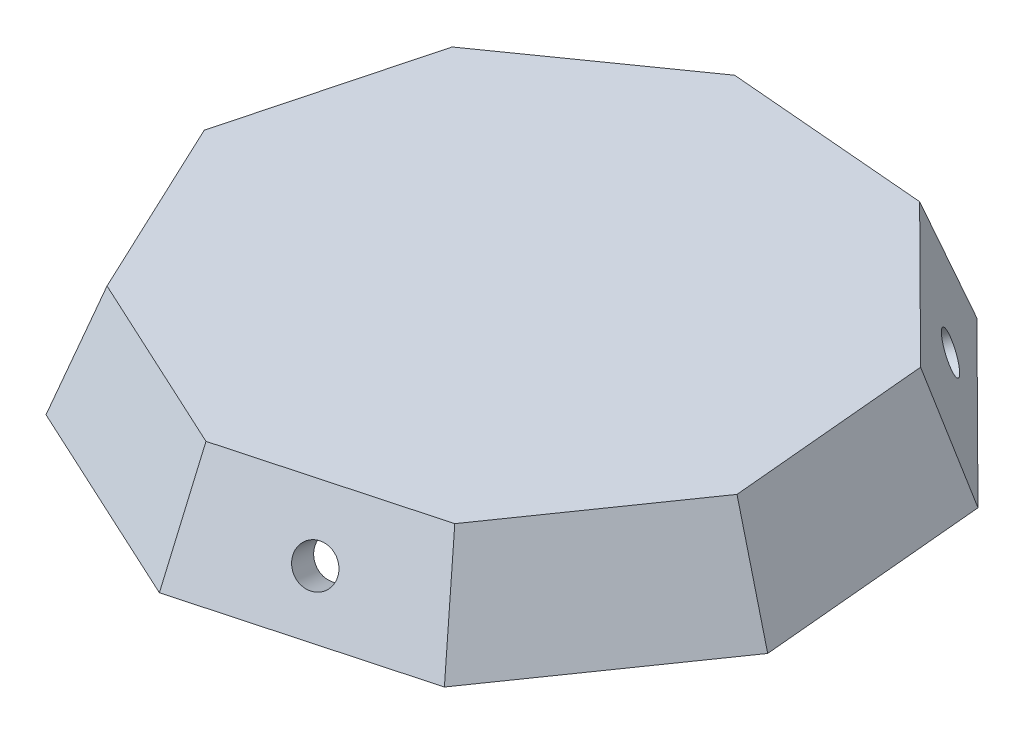
ISO-10303-21;
HEADER;
FILE_DESCRIPTION(('STEP AP214'),'2;1');
FILE_NAME('part.step','',(''),(''),'','','');
FILE_SCHEMA(('AUTOMOTIVE_DESIGN { 1 0 10303 214 1 1 1 1 }'));
ENDSEC;
DATA;
#1=APPLICATION_CONTEXT('core data for automotive mechanical design processes');
#2=APPLICATION_PROTOCOL_DEFINITION('international standard','automotive_design',2000,#1);
#3=PRODUCT_CONTEXT('',#1,'mechanical');
#4=PRODUCT('Part','Part','',(#3));
#5=PRODUCT_RELATED_PRODUCT_CATEGORY('part','',(#4));
#6=PRODUCT_DEFINITION_FORMATION('','',#4);
#7=PRODUCT_DEFINITION_CONTEXT('part definition',#1,'design');
#8=PRODUCT_DEFINITION('design','',#6,#7);
#9=PRODUCT_DEFINITION_SHAPE('','',#8);
#10=(LENGTH_UNIT() NAMED_UNIT(*) SI_UNIT(.MILLI.,.METRE.));
#11=(NAMED_UNIT(*) PLANE_ANGLE_UNIT() SI_UNIT($,.RADIAN.));
#12=(NAMED_UNIT(*) SI_UNIT($,.STERADIAN.) SOLID_ANGLE_UNIT());
#13=UNCERTAINTY_MEASURE_WITH_UNIT(LENGTH_MEASURE(1.E-05),#10,'distance_accuracy_value','');
#14=(GEOMETRIC_REPRESENTATION_CONTEXT(3) GLOBAL_UNCERTAINTY_ASSIGNED_CONTEXT((#13)) GLOBAL_UNIT_ASSIGNED_CONTEXT((#10,
#11,#12)) REPRESENTATION_CONTEXT('',''));
#15=CARTESIAN_POINT('',(0.,0.,0.));
#16=DIRECTION('',(0.,0.,1.));
#17=DIRECTION('',(1.,0.,0.));
#18=AXIS2_PLACEMENT_3D('',#15,#16,#17);
#19=CARTESIAN_POINT('',(15.3316909926271,10.,21.7424862527603));
#20=DIRECTION('',(0.771529898668877,0.342020143325669,0.536436237608423));
#21=DIRECTION('',(0.570863520413491,0.,-0.821044968964012));
#22=AXIS2_PLACEMENT_3D('',#19,#20,#21);
#23=PLANE('',#22);
#24=DIRECTION('',(-0.570863520413491,0.,0.821044968964012));
#25=VECTOR('',#24,1.);
#26=CARTESIAN_POINT('',(18.3200502895963,0.,23.8202595453495));
#27=LINE('',#26,#25);
#28=CARTESIAN_POINT('',(17.5638026575405,0.,24.907933378739));
#29=VERTEX_POINT('',#28);
#30=CARTESIAN_POINT('',(29.4651643845985,0.,7.79078922711416));
#31=VERTEX_POINT('',#30);
#32=EDGE_CURVE('E148',#29,#31,#27,.F.);
#33=ORIENTED_EDGE('',*,*,#32,.T.);
#34=DIRECTION('',(0.349182786412998,-0.932495167133387,0.0923262960685212));
#35=VECTOR('',#34,1.);
#36=CARTESIAN_POINT('',(25.7205574555735,10.,6.80068976791434));
#37=LINE('',#36,#35);
#38=CARTESIAN_POINT('',(25.7205574555735,10.,6.80068976791434));
#39=VERTEX_POINT('',#38);
#40=EDGE_CURVE('E11',#39,#31,#37,.T.);
#41=ORIENTED_EDGE('',*,*,#40,.F.);
#42=DIRECTION('',(0.570863520413491,0.,-0.821044968964012));
#43=VECTOR('',#42,1.);
#44=CARTESIAN_POINT('',(15.3316909926271,10.,21.7424862527603));
#45=LINE('',#44,#43);
#46=CARTESIAN_POINT('',(15.3316909926271,10.,21.7424862527603));
#47=VERTEX_POINT('',#46);
#48=EDGE_CURVE('E145',#47,#39,#45,.T.);
#49=ORIENTED_EDGE('',*,*,#48,.F.);
#50=DIRECTION('',(0.208143334003381,-0.932495167133387,0.295176414679144));
#51=VECTOR('',#50,1.);
#52=CARTESIAN_POINT('',(15.3316909926271,10.,21.7424862527603));
#53=LINE('',#52,#51);
#54=EDGE_CURVE('E169',#47,#29,#53,.T.);
#55=ORIENTED_EDGE('',*,*,#54,.T.);
#56=EDGE_LOOP('',(#33,#41,#49,#55));
#57=FACE_BOUND('',#56,.T.);
#58=ADVANCED_FACE('F45',(#57),#23,.T.);
#59=CARTESIAN_POINT('',(25.7205574555735,10.,6.80068976791434));
#60=DIRECTION('',(0.935840758497,0.342020143325669,-0.0849958604594809));
#61=DIRECTION('',(-0.343262305128028,0.939239580659904,0.));
#62=AXIS2_PLACEMENT_3D('',#59,#60,#61);
#63=PLANE('',#62);
#64=DIRECTION('',(0.0904507054534439,0.,0.995900933769506));
#65=VECTOR('',#64,1.);
#66=CARTESIAN_POINT('',(29.3453404172737,0.,6.47147612338001));
#67=LINE('',#66,#65);
#68=CARTESIAN_POINT('',(27.5794482272772,0.,-12.971751788855));
#69=VERTEX_POINT('',#68);
#70=EDGE_CURVE('E152',#31,#69,#67,.F.);
#71=ORIENTED_EDGE('',*,*,#70,.T.);
#72=DIRECTION('',(0.326835732325574,-0.932495167133387,-0.153724322565048));
#73=VECTOR('',#72,1.);
#74=CARTESIAN_POINT('',(24.0744892329018,10.,-11.3232250405865));
#75=LINE('',#74,#73);
#76=CARTESIAN_POINT('',(24.0744892329018,10.,-11.3232250405865));
#77=VERTEX_POINT('',#76);
#78=EDGE_CURVE('E55',#77,#69,#75,.T.);
#79=ORIENTED_EDGE('',*,*,#78,.F.);
#80=DIRECTION('',(-0.0904507054534439,0.,-0.995900933769506));
#81=VECTOR('',#80,1.);
#82=CARTESIAN_POINT('',(25.7205574555735,10.,6.80068976791434));
#83=LINE('',#82,#81);
#84=EDGE_CURVE('E209',#39,#77,#83,.T.);
#85=ORIENTED_EDGE('',*,*,#84,.F.);
#86=ORIENTED_EDGE('',*,*,#40,.T.);
#87=EDGE_LOOP('',(#71,#79,#85,#86));
#88=FACE_BOUND('',#87,.T.);
#89=ADVANCED_FACE('F349',(#88),#63,.T.);
#90=CARTESIAN_POINT('',(24.0744892329018,10.,-11.3232250405865));
#91=DIRECTION('',(0.662261326712877,0.342020143325669,-0.666657450794626));
#92=DIRECTION('',(-0.709442040991095,0.,-0.704763783458251));
#93=AXIS2_PLACEMENT_3D('',#90,#91,#92);
#94=PLANE('',#93);
#95=CARTESIAN_POINT('',(18.9790079289869,4.69846310392955,-19.1049915406506));
#96=DIRECTION('',(0.662261326712873,0.342020143325669,-0.666657450794629));
#97=DIRECTION('',(0.305605875423124,-0.935667354641855,-0.176441634441473));
#98=AXIS2_PLACEMENT_3D('',#95,#96,#97);
#99=CIRCLE('',#98,1.7);
#100=CARTESIAN_POINT('',(19.4985379172062,3.10782860103839,-19.4049423192011));
#101=VERTEX_POINT('',#100);
#102=EDGE_CURVE('E323',#101,#101,#99,.T.);
#103=ORIENTED_EDGE('',*,*,#102,.F.);
#104=EDGE_LOOP('',(#103));
#105=FACE_BOUND('',#104,.T.);
#106=DIRECTION('',(0.709442040991095,0.,0.704763783458251));
#107=VECTOR('',#106,1.);
#108=CARTESIAN_POINT('',(26.6396196265782,0.,-13.9053828991647));
#109=LINE('',#108,#107);
#110=CARTESIAN_POINT('',(12.789001732988,0.,-27.6646659778562));
#111=VERTEX_POINT('',#110);
#112=EDGE_CURVE('E156',#69,#111,#109,.F.);
#113=ORIENTED_EDGE('',*,*,#112,.T.);
#114=DIRECTION('',(0.151558606708458,-0.932495167133387,-0.32784562221489));
#115=VECTOR('',#114,1.);
#116=CARTESIAN_POINT('',(11.1636999400107,10.,-24.1488770089683));
#117=LINE('',#116,#115);
#118=CARTESIAN_POINT('',(11.1636999400107,10.,-24.1488770089683));
#119=VERTEX_POINT('',#118);
#120=EDGE_CURVE('E176',#119,#111,#117,.T.);
#121=ORIENTED_EDGE('',*,*,#120,.F.);
#122=DIRECTION('',(-0.709442040991095,0.,-0.704763783458252));
#123=VECTOR('',#122,1.);
#124=CARTESIAN_POINT('',(24.0744892329018,10.,-11.3232250405865));
#125=LINE('',#124,#123);
#126=EDGE_CURVE('E205',#77,#119,#125,.T.);
#127=ORIENTED_EDGE('',*,*,#126,.F.);
#128=ORIENTED_EDGE('',*,*,#78,.T.);
#129=EDGE_LOOP('',(#113,#121,#127,#128));
#130=FACE_BOUND('',#129,.T.);
#131=ADVANCED_FACE('F345',(#105,#130),#94,.T.);
#132=CARTESIAN_POINT('',(11.1636999400107,10.,-24.1488770089683));
#133=DIRECTION('',(0.0788024599450013,0.342020143325669,-0.936382610830693));
#134=DIRECTION('',(0.,0.939303609400127,0.343087058001163));
#135=AXIS2_PLACEMENT_3D('',#132,#133,#134);
#136=PLANE('',#135);
#137=DIRECTION('',(0.996477560978986,0.,0.0838598262898938));
#138=VECTOR('',#137,1.);
#139=CARTESIAN_POINT('',(11.4689247462133,0.,-27.7757587220736));
#140=LINE('',#139,#138);
#141=CARTESIAN_POINT('',(-7.98556080608825,0.,-29.4129754973038));
#142=VERTEX_POINT('',#141);
#143=EDGE_CURVE('E159',#111,#142,#140,.F.);
#144=ORIENTED_EDGE('',*,*,#143,.T.);
#145=DIRECTION('',(-0.0946344753738362,-0.932495167133387,-0.348564311632152));
#146=VECTOR('',#145,1.);
#147=CARTESIAN_POINT('',(-6.97070862551605,10.,-25.6750010399811));
#148=LINE('',#147,#146);
#149=CARTESIAN_POINT('',(-6.97070862551605,10.,-25.6750010399811));
#150=VERTEX_POINT('',#149);
#151=EDGE_CURVE('E180',#150,#142,#148,.T.);
#152=ORIENTED_EDGE('',*,*,#151,.F.);
#153=DIRECTION('',(-0.996477560978986,0.,-0.0838598262898938));
#154=VECTOR('',#153,1.);
#155=CARTESIAN_POINT('',(11.1636999400107,10.,-24.1488770089683));
#156=LINE('',#155,#154);
#157=EDGE_CURVE('E201',#119,#150,#156,.T.);
#158=ORIENTED_EDGE('',*,*,#157,.F.);
#159=ORIENTED_EDGE('',*,*,#120,.T.);
#160=EDGE_LOOP('',(#144,#152,#158,#159));
#161=FACE_BOUND('',#160,.T.);
#162=ADVANCED_FACE('F348',(#161),#136,.T.);
#163=CARTESIAN_POINT('',(-6.97070862551605,10.,-25.6750010399811));
#164=DIRECTION('',(-0.541528953622928,0.342020143325669,-0.76796394052556));
#165=DIRECTION('',(-0.817250155570314,0.,0.576283075597659));
#166=AXIS2_PLACEMENT_3D('',#163,#164,#165);
#167=PLANE('',#166);
#168=DIRECTION('',(0.817250155570314,0.,-0.576283075597659));
#169=VECTOR('',#168,1.);
#170=CARTESIAN_POINT('',(-9.06820748580533,0.,-28.6495483457512));
#171=LINE('',#170,#169);
#172=CARTESIAN_POINT('',(-25.0235906943733,0.,-17.3986268927523));
#173=VERTEX_POINT('',#172);
#174=EDGE_CURVE('E122',#142,#173,#171,.F.);
#175=ORIENTED_EDGE('',*,*,#174,.T.);
#176=DIRECTION('',(-0.296547034683672,-0.932495167133387,-0.206185885775914));
#177=VECTOR('',#176,1.);
#178=CARTESIAN_POINT('',(-21.8434451543669,10.,-15.1875067385347));
#179=LINE('',#178,#177);
#180=CARTESIAN_POINT('',(-21.8434451543669,10.,-15.1875067385347));
#181=VERTEX_POINT('',#180);
#182=EDGE_CURVE('E117',#181,#173,#179,.T.);
#183=ORIENTED_EDGE('',*,*,#182,.F.);
#184=DIRECTION('',(-0.817250155570314,0.,0.576283075597659));
#185=VECTOR('',#184,1.);
#186=CARTESIAN_POINT('',(-6.97070862551605,10.,-25.6750010399811));
#187=LINE('',#186,#185);
#188=EDGE_CURVE('E197',#150,#181,#187,.T.);
#189=ORIENTED_EDGE('',*,*,#188,.F.);
#190=ORIENTED_EDGE('',*,*,#151,.T.);
#191=EDGE_LOOP('',(#175,#183,#189,#190));
#192=FACE_BOUND('',#191,.T.);
#193=ADVANCED_FACE('F361',(#192),#167,.T.);
#194=CARTESIAN_POINT('',(-21.8434451543669,10.,-15.1875067385347));
#195=DIRECTION('',(-0.908472951366759,0.342020143325669,-0.240206407480024));
#196=DIRECTION('',(-0.352335891537493,-0.935873613013253,0.));
#197=AXIS2_PLACEMENT_3D('',#194,#195,#196);
#198=PLANE('',#197);
#199=CARTESIAN_POINT('',(-26.0349119777837,4.69846310392955,-6.88380723480354));
#200=DIRECTION('',(-0.908472951366761,0.342020143325669,-0.240206407480015));
#201=DIRECTION('',(-0.305605875423126,-0.935667354641855,-0.176441634441469));
#202=AXIS2_PLACEMENT_3D('',#199,#200,#201);
#203=CIRCLE('',#202,1.7);
#204=CARTESIAN_POINT('',(-26.554441966003,3.10782860103839,-7.18375801335404));
#205=VERTEX_POINT('',#204);
#206=EDGE_CURVE('E331',#205,#205,#203,.T.);
#207=ORIENTED_EDGE('',*,*,#206,.F.);
#208=EDGE_LOOP('',(#207));
#209=FACE_BOUND('',#208,.T.);
#210=DIRECTION('',(0.255622319646533,0.,-0.966776721740095));
#211=VECTOR('',#210,1.);
#212=CARTESIAN_POINT('',(-25.3622246533155,0.,-16.1178958941889));
#213=LINE('',#212,#211);
#214=CARTESIAN_POINT('',(-30.3528043905286,0.,2.75673259911723));
#215=VERTEX_POINT('',#214);
#216=EDGE_CURVE('E109',#173,#215,#213,.F.);
#217=ORIENTED_EDGE('',*,*,#216,.T.);
#218=DIRECTION('',(-0.35970194071184,-0.932495167133387,0.0326692075357454));
#219=VECTOR('',#218,1.);
#220=CARTESIAN_POINT('',(-26.4953909326379,10.,2.40639075620801));
#221=LINE('',#220,#219);
#222=CARTESIAN_POINT('',(-26.4953909326379,10.,2.40639075620801));
#223=VERTEX_POINT('',#222);
#224=EDGE_CURVE('E114',#223,#215,#221,.T.);
#225=ORIENTED_EDGE('',*,*,#224,.F.);
#226=DIRECTION('',(-0.255622319646533,0.,0.966776721740095));
#227=VECTOR('',#226,1.);
#228=CARTESIAN_POINT('',(-21.8434451543669,10.,-15.1875067385347));
#229=LINE('',#228,#227);
#230=EDGE_CURVE('E193',#181,#223,#229,.T.);
#231=ORIENTED_EDGE('',*,*,#230,.F.);
#232=ORIENTED_EDGE('',*,*,#182,.T.);
#233=EDGE_LOOP('',(#217,#225,#231,#232));
#234=FACE_BOUND('',#233,.T.);
#235=ADVANCED_FACE('F111',(#209,#234),#198,.T.);
#236=CARTESIAN_POINT('',(-26.4953909326379,10.,2.40639075620801));
#237=DIRECTION('',(-0.850332358613878,0.342020143325669,0.39994637322227));
#238=DIRECTION('',(0.425614040565495,0.,0.904904795253906));
#239=AXIS2_PLACEMENT_3D('',#236,#237,#238);
#240=PLANE('',#239);
#241=DIRECTION('',(-0.425614040565495,0.,-0.904904795253906));
#242=VECTOR('',#241,1.);
#243=CARTESIAN_POINT('',(-29.7889750358096,0.,3.95549917672409));
#244=LINE('',#243,#242);
#245=CARTESIAN_POINT('',(-21.4796035785102,0.,21.6221862701897));
#246=VERTEX_POINT('',#245);
#247=EDGE_CURVE('E49',#215,#246,#244,.F.);
#248=ORIENTED_EDGE('',*,*,#247,.T.);
#249=DIRECTION('',(-0.254548311039161,-0.932495167133387,0.256238015563631));
#250=VECTOR('',#249,1.);
#251=CARTESIAN_POINT('',(-18.7498488300575,10.,18.8743112720667));
#252=LINE('',#251,#250);
#253=CARTESIAN_POINT('',(-18.7498488300575,10.,18.8743112720667));
#254=VERTEX_POINT('',#253);
#255=EDGE_CURVE('E131',#254,#246,#252,.T.);
#256=ORIENTED_EDGE('',*,*,#255,.F.);
#257=DIRECTION('',(0.425614040565495,0.,0.904904795253906));
#258=VECTOR('',#257,1.);
#259=CARTESIAN_POINT('',(-26.4953909326379,10.,2.40639075620801));
#260=LINE('',#259,#258);
#261=EDGE_CURVE('E129',#223,#254,#260,.T.);
#262=ORIENTED_EDGE('',*,*,#261,.F.);
#263=ORIENTED_EDGE('',*,*,#224,.T.);
#264=EDGE_LOOP('',(#248,#256,#262,#263));
#265=FACE_BOUND('',#264,.T.);
#266=ADVANCED_FACE('F125',(#265),#240,.T.);
#267=CARTESIAN_POINT('',(-18.7498488300575,10.,18.8743112720667));
#268=DIRECTION('',(-0.394311804874072,0.342020143325669,0.85295980098504));
#269=DIRECTION('',(0.907700861023758,0.,0.419617858171847));
#270=AXIS2_PLACEMENT_3D('',#267,#268,#269);
#271=PLANE('',#270);
#272=DIRECTION('',(-0.907700861023758,0.,-0.419617858171847));
#273=VECTOR('',#272,1.);
#274=CARTESIAN_POINT('',(-20.2771329314684,0.,22.1780722223712));
#275=LINE('',#274,#273);
#276=CARTESIAN_POINT('',(-2.55585753290394,0.,30.3703786816073));
#277=VERTEX_POINT('',#276);
#278=EDGE_CURVE('E137',#246,#277,#275,.F.);
#279=ORIENTED_EDGE('',*,*,#278,.T.);
#280=DIRECTION('',(-0.0302886976419022,-0.932495167133387,0.359910208340962));
#281=VECTOR('',#280,1.);
#282=CARTESIAN_POINT('',(-2.23104407853491,10.,26.5107317791212));
#283=LINE('',#282,#281);
#284=CARTESIAN_POINT('',(-2.23104407853491,10.,26.5107317791212));
#285=VERTEX_POINT('',#284);
#286=EDGE_CURVE('E166',#285,#277,#283,.T.);
#287=ORIENTED_EDGE('',*,*,#286,.F.);
#288=DIRECTION('',(0.907700861023758,0.,0.419617858171847));
#289=VECTOR('',#288,1.);
#290=CARTESIAN_POINT('',(-18.7498488300575,10.,18.8743112720667));
#291=LINE('',#290,#289);
#292=EDGE_CURVE('E188',#254,#285,#291,.T.);
#293=ORIENTED_EDGE('',*,*,#292,.F.);
#294=ORIENTED_EDGE('',*,*,#255,.T.);
#295=EDGE_LOOP('',(#279,#287,#293,#294));
#296=FACE_BOUND('',#295,.T.);
#297=ADVANCED_FACE('F373',(#296),#271,.T.);
#298=CARTESIAN_POINT('',(-2.23104407853491,10.,26.5107317791212));
#299=DIRECTION('',(0.246211624653882,0.342020143325669,0.90686385827465));
#300=DIRECTION('',(0.,-0.935667354641855,0.352883268882944));
#301=AXIS2_PLACEMENT_3D('',#298,#299,#300);
#302=PLANE('',#301);
#303=CARTESIAN_POINT('',(7.05590404879661,4.69846310392955,25.9887987754543));
#304=DIRECTION('',(0.246211624653883,0.342020143325669,0.90686385827465));
#305=DIRECTION('',(0.,-0.935667354641855,0.352883268882944));
#306=AXIS2_PLACEMENT_3D('',#303,#304,#305);
#307=CIRCLE('',#306,1.7);
#308=CARTESIAN_POINT('',(7.05590404879661,3.10782860103839,26.5887003325553));
#309=VERTEX_POINT('',#308);
#310=EDGE_CURVE('E250',#309,#309,#307,.T.);
#311=ORIENTED_EDGE('',*,*,#310,.F.);
#312=EDGE_LOOP('',(#311));
#313=FACE_BOUND('',#312,.T.);
#314=DIRECTION('',(-0.965064360637629,0.,0.262012938281844));
#315=VECTOR('',#314,1.);
#316=CARTESIAN_POINT('',(-1.27739497326272,0.,30.0232787933536));
#317=LINE('',#316,#315);
#318=EDGE_CURVE('E140',#277,#29,#317,.F.);
#319=ORIENTED_EDGE('',*,*,#318,.T.);
#320=ORIENTED_EDGE('',*,*,#54,.F.);
#321=DIRECTION('',(0.965064360637628,0.,-0.262012938281844));
#322=VECTOR('',#321,1.);
#323=CARTESIAN_POINT('',(-2.23104407853491,10.,26.5107317791212));
#324=LINE('',#323,#322);
#325=EDGE_CURVE('E72',#285,#47,#324,.T.);
#326=ORIENTED_EDGE('',*,*,#325,.F.);
#327=ORIENTED_EDGE('',*,*,#286,.T.);
#328=EDGE_LOOP('',(#319,#320,#326,#327));
#329=FACE_BOUND('',#328,.T.);
#330=ADVANCED_FACE('F47',(#313,#329),#302,.T.);
#331=CARTESIAN_POINT('',(0.,10.,0.));
#332=DIRECTION('',(0.,1.,0.));
#333=DIRECTION('',(0.,0.,1.));
#334=AXIS2_PLACEMENT_3D('',#331,#332,#333);
#335=PLANE('',#334);
#336=ORIENTED_EDGE('',*,*,#48,.T.);
#337=ORIENTED_EDGE('',*,*,#84,.T.);
#338=ORIENTED_EDGE('',*,*,#126,.T.);
#339=ORIENTED_EDGE('',*,*,#157,.T.);
#340=ORIENTED_EDGE('',*,*,#188,.T.);
#341=ORIENTED_EDGE('',*,*,#230,.T.);
#342=ORIENTED_EDGE('',*,*,#261,.T.);
#343=ORIENTED_EDGE('',*,*,#292,.T.);
#344=ORIENTED_EDGE('',*,*,#325,.T.);
#345=EDGE_LOOP('',(#336,#337,#338,#339,#340,#341,#342,#343,#344));
#346=FACE_BOUND('',#345,.T.);
#347=ADVANCED_FACE('F371',(#346),#335,.T.);
#348=CARTESIAN_POINT('',(0.,0.,0.));
#349=DIRECTION('',(0.,1.,0.));
#350=DIRECTION('',(0.,0.,1.));
#351=AXIS2_PLACEMENT_3D('',#348,#349,#350);
#352=PLANE('',#351);
#353=DIRECTION('',(-0.965064360637629,0.,0.262012938281844));
#354=VECTOR('',#353,1.);
#355=CARTESIAN_POINT('',(-2.11388000832465,0.,26.9422786685559));
#356=LINE('',#355,#354);
#357=CARTESIAN_POINT('',(-2.27095023076904,0.,26.9849229026379));
#358=VERTEX_POINT('',#357);
#359=CARTESIAN_POINT('',(15.6059252852818,0.,22.1313889081129));
#360=VERTEX_POINT('',#359);
#361=EDGE_CURVE('E242',#358,#360,#356,.F.);
#362=ORIENTED_EDGE('',*,*,#361,.T.);
#363=DIRECTION('',(-0.570863520413491,0.,0.821044968964012));
#364=VECTOR('',#363,1.);
#365=CARTESIAN_POINT('',(15.6988368710723,0.,21.9977587367254));
#366=LINE('',#365,#364);
#367=CARTESIAN_POINT('',(26.1806149198091,0.,6.92233208049191));
#368=VERTEX_POINT('',#367);
#369=EDGE_CURVE('E219',#360,#368,#366,.F.);
#370=ORIENTED_EDGE('',*,*,#369,.T.);
#371=DIRECTION('',(0.0904507054534439,0.,0.995900933769506));
#372=VECTOR('',#371,1.);
#373=CARTESIAN_POINT('',(26.1658935053571,0.,6.76024301412497));
#374=LINE('',#373,#372);
#375=CARTESIAN_POINT('',(24.5051038682334,0.,-11.5257608607428));
#376=VERTEX_POINT('',#375);
#377=EDGE_CURVE('E215',#368,#376,#374,.F.);
#378=ORIENTED_EDGE('',*,*,#377,.T.);
#379=DIRECTION('',(0.709442040991095,0.,0.704763783458251));
#380=VECTOR('',#379,1.);
#381=CARTESIAN_POINT('',(24.3896377669713,0.,-11.6404655465167));
#382=LINE('',#381,#380);
#383=CARTESIAN_POINT('',(11.363382372818,0.,-24.5808222006724));
#384=VERTEX_POINT('',#383);
#385=EDGE_CURVE('E63',#376,#384,#382,.F.);
#386=ORIENTED_EDGE('',*,*,#385,.T.);
#387=DIRECTION('',(0.996477560978986,0.,0.0838598262898938));
#388=VECTOR('',#387,1.);
#389=CARTESIAN_POINT('',(11.2011994567891,0.,-24.5944709085791));
#390=LINE('',#389,#388);
#391=CARTESIAN_POINT('',(-7.09539202476662,0.,-26.1342436474986));
#392=VERTEX_POINT('',#391);
#393=EDGE_CURVE('E222',#384,#392,#390,.F.);
#394=ORIENTED_EDGE('',*,*,#393,.T.);
#395=DIRECTION('',(0.817250155570314,0.,-0.576283075597659));
#396=VECTOR('',#395,1.);
#397=CARTESIAN_POINT('',(-7.22840456669007,0.,-26.04044999542));
#398=LINE('',#397,#396);
#399=CARTESIAN_POINT('',(-22.2341536374644,0.,-15.4591620418951));
#400=VERTEX_POINT('',#399);
#401=EDGE_CURVE('E226',#392,#400,#398,.F.);
#402=ORIENTED_EDGE('',*,*,#401,.T.);
#403=DIRECTION('',(0.255622319646533,0.,-0.966776721740095));
#404=VECTOR('',#403,1.);
#405=CARTESIAN_POINT('',(-22.2757577586467,0.,-15.3018131220391));
#406=LINE('',#405,#404);
#407=CARTESIAN_POINT('',(-26.9693076580998,0.,2.44943329255946));
#408=VERTEX_POINT('',#407);
#409=EDGE_CURVE('E230',#400,#408,#406,.F.);
#410=ORIENTED_EDGE('',*,*,#409,.T.);
#411=DIRECTION('',(-0.425614040565495,0.,-0.904904795253906));
#412=VECTOR('',#411,1.);
#413=CARTESIAN_POINT('',(-26.9000363278614,0.,2.59671217185371));
#414=LINE('',#413,#412);
#415=CARTESIAN_POINT('',(-19.0852228950425,0.,19.2119115670067));
#416=VERTEX_POINT('',#415);
#417=EDGE_CURVE('E234',#408,#416,#414,.F.);
#418=ORIENTED_EDGE('',*,*,#417,.T.);
#419=DIRECTION('',(-0.907700861023758,0.,-0.419617858171847));
#420=VECTOR('',#419,1.);
#421=CARTESIAN_POINT('',(-18.9374889386671,0.,19.2802069812951));
#422=LINE('',#421,#420);
#423=EDGE_CURVE('E238',#416,#358,#422,.F.);
#424=ORIENTED_EDGE('',*,*,#423,.T.);
#425=EDGE_LOOP('',(#362,#370,#378,#386,#394,#402,#410,#418,#424));
#426=FACE_BOUND('',#425,.T.);
#427=ORIENTED_EDGE('',*,*,#32,.F.);
#428=ORIENTED_EDGE('',*,*,#318,.F.);
#429=ORIENTED_EDGE('',*,*,#278,.F.);
#430=ORIENTED_EDGE('',*,*,#247,.F.);
#431=ORIENTED_EDGE('',*,*,#216,.F.);
#432=ORIENTED_EDGE('',*,*,#174,.F.);
#433=ORIENTED_EDGE('',*,*,#143,.F.);
#434=ORIENTED_EDGE('',*,*,#112,.F.);
#435=ORIENTED_EDGE('',*,*,#70,.F.);
#436=EDGE_LOOP('',(#427,#428,#429,#430,#431,#432,#433,#434,#435));
#437=FACE_BOUND('',#436,.T.);
#438=ADVANCED_FACE('F135',(#426,#437),#352,.F.);
#439=CARTESIAN_POINT('',(13.0171012966205,8.97393957002299,20.133177539935));
#440=DIRECTION('',(0.771529898668877,0.342020143325669,0.536436237608423));
#441=DIRECTION('',(0.570863520413491,0.,-0.821044968964012));
#442=AXIS2_PLACEMENT_3D('',#439,#440,#441);
#443=PLANE('',#442);
#444=ORIENTED_EDGE('',*,*,#369,.F.);
#445=DIRECTION('',(0.208143334003381,-0.932495167133387,0.295176414679144));
#446=VECTOR('',#445,1.);
#447=CARTESIAN_POINT('',(13.629224133729,8.85574491018799,19.3281496806774));
#448=LINE('',#447,#446);
#449=CARTESIAN_POINT('',(14.0434471198424,7.,19.9155759199278));
#450=VERTEX_POINT('',#449);
#451=EDGE_CURVE('E255',#450,#360,#448,.T.);
#452=ORIENTED_EDGE('',*,*,#451,.F.);
#453=DIRECTION('',(-0.570863520413491,0.,0.821044968964012));
#454=VECTOR('',#453,1.);
#455=CARTESIAN_POINT('',(13.6069853631938,7.,20.5433174319129));
#456=LINE('',#455,#454);
#457=CARTESIAN_POINT('',(23.5593900694917,7.,6.22926245905203));
#458=VERTEX_POINT('',#457);
#459=EDGE_CURVE('E246',#450,#458,#456,.F.);
#460=ORIENTED_EDGE('',*,*,#459,.T.);
#461=DIRECTION('',(0.349182786412998,-0.932495167133387,0.0923262960685212));
#462=VECTOR('',#461,1.);
#463=CARTESIAN_POINT('',(22.8644865445724,8.85574491018799,6.04552525585304));
#464=LINE('',#463,#462);
#465=EDGE_CURVE('E153',#458,#368,#464,.T.);
#466=ORIENTED_EDGE('',*,*,#465,.T.);
#467=EDGE_LOOP('',(#444,#452,#460,#466));
#468=FACE_BOUND('',#467,.T.);
#469=ADVANCED_FACE('F427',(#468),#443,.F.);
#470=CARTESIAN_POINT('',(22.9130351800825,8.97393957002299,7.05567734929278));
#471=DIRECTION('',(0.935840758497,0.342020143325669,-0.0849958604594809));
#472=DIRECTION('',(-0.343262305128028,0.939239580659904,0.));
#473=AXIS2_PLACEMENT_3D('',#470,#471,#472);
#474=PLANE('',#473);
#475=ORIENTED_EDGE('',*,*,#377,.F.);
#476=ORIENTED_EDGE('',*,*,#465,.F.);
#477=DIRECTION('',(0.0904507054534439,0.,0.995900933769506));
#478=VECTOR('',#477,1.);
#479=CARTESIAN_POINT('',(23.628545432167,7.,6.990692565299));
#480=LINE('',#479,#478);
#481=CARTESIAN_POINT('',(22.0516325721707,7.,-10.3717921369549));
#482=VERTEX_POINT('',#481);
#483=EDGE_CURVE('E301',#458,#482,#480,.F.);
#484=ORIENTED_EDGE('',*,*,#483,.T.);
#485=DIRECTION('',(0.326835732325574,-0.932495167133387,-0.153724322565048));
#486=VECTOR('',#485,1.);
#487=CARTESIAN_POINT('',(21.4012015907477,8.85574491018799,-10.0658676247141));
#488=LINE('',#487,#486);
#489=EDGE_CURVE('E304',#482,#376,#488,.T.);
#490=ORIENTED_EDGE('',*,*,#489,.T.);
#491=EDGE_LOOP('',(#475,#476,#484,#490));
#492=FACE_BOUND('',#491,.T.);
#493=ADVANCED_FACE('F428',(#492),#474,.F.);
#494=CARTESIAN_POINT('',(22.0877052527632,8.97393957002299,-9.32325268820263));
#495=DIRECTION('',(0.662261326712877,0.342020143325669,-0.666657450794626));
#496=DIRECTION('',(-0.709442040991095,0.,-0.704763783458251));
#497=AXIS2_PLACEMENT_3D('',#494,#495,#496);
#498=PLANE('',#497);
#499=CARTESIAN_POINT('',(16.9922239488483,3.67240267395253,-17.1050191882667));
#500=DIRECTION('',(0.662261326712877,0.342020143325669,-0.666657450794626));
#501=DIRECTION('',(-0.709442040991095,0.,-0.704763783458251));
#502=AXIS2_PLACEMENT_3D('',#499,#500,#501);
#503=CIRCLE('',#502,1.7);
#504=CARTESIAN_POINT('',(15.7861724791634,3.67240267395253,-18.3031176201457));
#505=VERTEX_POINT('',#504);
#506=EDGE_CURVE('E335',#505,#505,#503,.T.);
#507=ORIENTED_EDGE('',*,*,#506,.T.);
#508=EDGE_LOOP('',(#507));
#509=FACE_BOUND('',#508,.T.);
#510=ORIENTED_EDGE('',*,*,#385,.F.);
#511=ORIENTED_EDGE('',*,*,#489,.F.);
#512=DIRECTION('',(0.709442040991095,0.,0.704763783458251));
#513=VECTOR('',#512,1.);
#514=CARTESIAN_POINT('',(22.5940464913978,7.,-9.83295504551197));
#515=LINE('',#514,#513);
#516=CARTESIAN_POINT('',(10.2256711177339,7.,-22.1197699224508));
#517=VERTEX_POINT('',#516);
#518=EDGE_CURVE('E293',#482,#517,#515,.F.);
#519=ORIENTED_EDGE('',*,*,#518,.T.);
#520=DIRECTION('',(0.151558606708458,-0.932495167133387,-0.32784562221489));
#521=VECTOR('',#520,1.);
#522=CARTESIAN_POINT('',(9.92405656475019,8.85574491018799,-21.4673291740199));
#523=LINE('',#522,#521);
#524=EDGE_CURVE('E297',#517,#384,#523,.T.);
#525=ORIENTED_EDGE('',*,*,#524,.T.);
#526=EDGE_LOOP('',(#510,#511,#519,#525));
#527=FACE_BOUND('',#526,.T.);
#528=ADVANCED_FACE('F458',(#509,#527),#498,.F.);
#529=CARTESIAN_POINT('',(10.9272925601757,8.97393957002299,-21.3397291764762));
#530=DIRECTION('',(0.0788024599450013,0.342020143325669,-0.936382610830693));
#531=DIRECTION('',(0.,0.939303609400127,0.343087058001163));
#532=AXIS2_PLACEMENT_3D('',#529,#530,#531);
#533=PLANE('',#532);
#534=ORIENTED_EDGE('',*,*,#393,.F.);
#535=ORIENTED_EDGE('',*,*,#524,.F.);
#536=DIRECTION('',(0.996477560978986,0.,0.0838598262898938));
#537=VECTOR('',#536,1.);
#538=CARTESIAN_POINT('',(10.9875420924473,7.,-22.0556537094053));
#539=LINE('',#538,#537);
#540=CARTESIAN_POINT('',(-6.38499549836607,7.,-23.5176615273726));
#541=VERTEX_POINT('',#540);
#542=EDGE_CURVE('E285',#517,#541,#539,.F.);
#543=ORIENTED_EDGE('',*,*,#542,.T.);
#544=DIRECTION('',(-0.0946344753738362,-0.932495167133387,-0.348564311632152));
#545=VECTOR('',#544,1.);
#546=CARTESIAN_POINT('',(-6.19666482149707,8.85574491018799,-22.8239888200137));
#547=LINE('',#546,#545);
#548=EDGE_CURVE('E289',#541,#392,#547,.T.);
#549=ORIENTED_EDGE('',*,*,#548,.T.);
#550=EDGE_LOOP('',(#534,#535,#543,#549));
#551=FACE_BOUND('',#550,.T.);
#552=ADVANCED_FACE('F456',(#551),#533,.F.);
#553=CARTESIAN_POINT('',(-5.34612176464726,8.97393957002299,-23.3711092184044));
#554=DIRECTION('',(-0.541528953622928,0.342020143325669,-0.76796394052556));
#555=DIRECTION('',(-0.817250155570314,0.,0.576283075597659));
#556=AXIS2_PLACEMENT_3D('',#553,#554,#555);
#557=PLANE('',#556);
#558=ORIENTED_EDGE('',*,*,#401,.F.);
#559=ORIENTED_EDGE('',*,*,#548,.F.);
#560=DIRECTION('',(0.817250155570314,0.,-0.576283075597659));
#561=VECTOR('',#560,1.);
#562=CARTESIAN_POINT('',(-5.76015536448758,7.,-23.9582668813809));
#563=LINE('',#562,#561);
#564=CARTESIAN_POINT('',(-20.00805175946,7.,-13.9113779339428));
#565=VERTEX_POINT('',#564);
#566=EDGE_CURVE('E277',#541,#565,#563,.F.);
#567=ORIENTED_EDGE('',*,*,#566,.T.);
#568=DIRECTION('',(-0.296547034683672,-0.932495167133387,-0.206185885775914));
#569=VECTOR('',#568,1.);
#570=CARTESIAN_POINT('',(-19.4178978695076,8.85574491018799,-13.5010504367424));
#571=LINE('',#570,#569);
#572=EDGE_CURVE('E281',#565,#400,#571,.T.);
#573=ORIENTED_EDGE('',*,*,#572,.T.);
#574=EDGE_LOOP('',(#558,#559,#567,#573));
#575=FACE_BOUND('',#574,.T.);
#576=ADVANCED_FACE('F453',(#575),#557,.F.);
#577=CARTESIAN_POINT('',(-19.1180263002667,8.97393957002299,-14.4668875160946));
#578=DIRECTION('',(-0.908472951366759,0.342020143325669,-0.240206407480024));
#579=DIRECTION('',(-0.352335891537493,-0.935873613013253,0.));
#580=AXIS2_PLACEMENT_3D('',#577,#578,#579);
#581=PLANE('',#580);
#582=CARTESIAN_POINT('',(-23.3094931236834,3.67240267395254,-6.1631880123635));
#583=DIRECTION('',(-0.908472951366759,0.342020143325669,-0.240206407480024));
#584=DIRECTION('',(-0.352335891537493,-0.935873613013253,0.));
#585=AXIS2_PLACEMENT_3D('',#582,#583,#584);
#586=CIRCLE('',#585,1.7);
#587=CARTESIAN_POINT('',(-23.9084641392971,2.08141753183001,-6.1631880123635));
#588=VERTEX_POINT('',#587);
#589=EDGE_CURVE('E327',#588,#588,#586,.T.);
#590=ORIENTED_EDGE('',*,*,#589,.T.);
#591=EDGE_LOOP('',(#590));
#592=FACE_BOUND('',#591,.T.);
#593=ORIENTED_EDGE('',*,*,#409,.F.);
#594=ORIENTED_EDGE('',*,*,#572,.F.);
#595=DIRECTION('',(0.255622319646533,0.,-0.966776721740095));
#596=VECTOR('',#595,1.);
#597=CARTESIAN_POINT('',(-19.8126121093827,7.,-14.6505407130812));
#598=LINE('',#597,#596);
#599=CARTESIAN_POINT('',(-24.2691182375763,7.,2.20419400252301));
#600=VERTEX_POINT('',#599);
#601=EDGE_CURVE('E269',#565,#600,#598,.F.);
#602=ORIENTED_EDGE('',*,*,#601,.T.);
#603=DIRECTION('',(-0.35970194071184,-0.932495167133387,0.0326692075357454));
#604=VECTOR('',#603,1.);
#605=CARTESIAN_POINT('',(-23.5532806984792,8.85574491018799,2.13917949334254));
#606=LINE('',#605,#604);
#607=EDGE_CURVE('E273',#600,#408,#606,.T.);
#608=ORIENTED_EDGE('',*,*,#607,.T.);
#609=EDGE_LOOP('',(#593,#594,#602,#608));
#610=FACE_BOUND('',#609,.T.);
#611=ADVANCED_FACE('F447',(#592,#610),#581,.F.);
#612=CARTESIAN_POINT('',(-23.9443938567962,8.97393957002299,1.2065516365412));
#613=DIRECTION('',(-0.850332358613878,0.342020143325669,0.39994637322227));
#614=DIRECTION('',(0.425614040565495,0.,0.904904795253906));
#615=AXIS2_PLACEMENT_3D('',#612,#613,#614);
#616=PLANE('',#615);
#617=ORIENTED_EDGE('',*,*,#417,.F.);
#618=ORIENTED_EDGE('',*,*,#607,.F.);
#619=DIRECTION('',(-0.425614040565495,0.,-0.904904795253906));
#620=VECTOR('',#619,1.);
#621=CARTESIAN_POINT('',(-24.5945274556412,7.,1.51233627749245));
#622=LINE('',#621,#620);
#623=CARTESIAN_POINT('',(-17.1743945711256,7.,17.2883990683206));
#624=VERTEX_POINT('',#623);
#625=EDGE_CURVE('E260',#600,#624,#622,.F.);
#626=ORIENTED_EDGE('',*,*,#625,.T.);
#627=DIRECTION('',(-0.254548311039161,-0.932495167133387,0.256238015563631));
#628=VECTOR('',#627,1.);
#629=CARTESIAN_POINT('',(-16.6678217230753,8.85574491018799,16.7784635641607));
#630=LINE('',#629,#628);
#631=EDGE_CURVE('E265',#624,#416,#630,.T.);
#632=ORIENTED_EDGE('',*,*,#631,.T.);
#633=EDGE_LOOP('',(#617,#618,#626,#632));
#634=FACE_BOUND('',#633,.T.);
#635=ADVANCED_FACE('F443',(#634),#616,.F.);
#636=CARTESIAN_POINT('',(-17.5669134154352,8.97393957002299,16.3154318691116));
#637=DIRECTION('',(-0.394311804874072,0.342020143325669,0.85295980098504));
#638=DIRECTION('',(0.907700861023758,0.,0.419617858171847));
#639=AXIS2_PLACEMENT_3D('',#636,#637,#638);
#640=PLANE('',#639);
#641=ORIENTED_EDGE('',*,*,#423,.F.);
#642=ORIENTED_EDGE('',*,*,#631,.F.);
#643=DIRECTION('',(-0.907700861023758,0.,-0.419617858171847));
#644=VECTOR('',#643,1.);
#645=CARTESIAN_POINT('',(-17.8683900676794,7.,16.9675743160819));
#646=LINE('',#645,#644);
#647=CARTESIAN_POINT('',(-2.04358081271072,7.,24.2831700708976));
#648=VERTEX_POINT('',#647);
#649=EDGE_CURVE('E256',#624,#648,#646,.F.);
#650=ORIENTED_EDGE('',*,*,#649,.T.);
#651=DIRECTION('',(-0.0302886976419022,-0.932495167133387,0.359910208340962));
#652=VECTOR('',#651,1.);
#653=CARTESIAN_POINT('',(-1.98330372124013,8.85574491018799,23.5669180614565));
#654=LINE('',#653,#652);
#655=EDGE_CURVE('E261',#648,#358,#654,.T.);
#656=ORIENTED_EDGE('',*,*,#655,.T.);
#657=EDGE_LOOP('',(#641,#642,#650,#656));
#658=FACE_BOUND('',#657,.T.);
#659=ADVANCED_FACE('F440',(#658),#640,.F.);
#660=CARTESIAN_POINT('',(-2.96967895249656,8.97393957002299,23.7901402042972));
#661=DIRECTION('',(0.246211624653882,0.342020143325669,0.90686385827465));
#662=DIRECTION('',(0.,-0.935667354641855,0.352883268882944));
#663=AXIS2_PLACEMENT_3D('',#660,#661,#662);
#664=PLANE('',#663);
#665=CARTESIAN_POINT('',(6.31726917483496,3.67240267395253,23.2682072006303));
#666=DIRECTION('',(0.246211624653882,0.342020143325669,0.90686385827465));
#667=DIRECTION('',(0.,-0.935667354641855,0.352883268882944));
#668=AXIS2_PLACEMENT_3D('',#665,#666,#667);
#669=CIRCLE('',#668,1.7);
#670=CARTESIAN_POINT('',(6.31726917483496,2.08176817106138,23.8681087577313));
#671=VERTEX_POINT('',#670);
#672=EDGE_CURVE('E319',#671,#671,#669,.T.);
#673=ORIENTED_EDGE('',*,*,#672,.T.);
#674=EDGE_LOOP('',(#673));
#675=FACE_BOUND('',#674,.T.);
#676=ORIENTED_EDGE('',*,*,#361,.F.);
#677=ORIENTED_EDGE('',*,*,#655,.F.);
#678=DIRECTION('',(-0.965064360637629,0.,0.262012938281844));
#679=VECTOR('',#678,1.);
#680=CARTESIAN_POINT('',(-2.78143438201518,7.,24.4834957585932));
#681=LINE('',#680,#679);
#682=EDGE_CURVE('E251',#648,#450,#681,.F.);
#683=ORIENTED_EDGE('',*,*,#682,.T.);
#684=ORIENTED_EDGE('',*,*,#451,.T.);
#685=EDGE_LOOP('',(#676,#677,#683,#684));
#686=FACE_BOUND('',#685,.T.);
#687=ADVANCED_FACE('F434',(#675,#686),#664,.F.);
#688=CARTESIAN_POINT('',(0.,7.,0.));
#689=DIRECTION('',(0.,1.,0.));
#690=DIRECTION('',(0.,0.,1.));
#691=AXIS2_PLACEMENT_3D('',#688,#689,#690);
#692=PLANE('',#691);
#693=ORIENTED_EDGE('',*,*,#459,.F.);
#694=ORIENTED_EDGE('',*,*,#682,.F.);
#695=ORIENTED_EDGE('',*,*,#649,.F.);
#696=ORIENTED_EDGE('',*,*,#625,.F.);
#697=ORIENTED_EDGE('',*,*,#601,.F.);
#698=ORIENTED_EDGE('',*,*,#566,.F.);
#699=ORIENTED_EDGE('',*,*,#542,.F.);
#700=ORIENTED_EDGE('',*,*,#518,.F.);
#701=ORIENTED_EDGE('',*,*,#483,.F.);
#702=EDGE_LOOP('',(#693,#694,#695,#696,#697,#698,#699,#700,#701));
#703=FACE_BOUND('',#702,.T.);
#704=ADVANCED_FACE('F419',(#703),#692,.F.);
#705=CARTESIAN_POINT('',(-7.97797220389906,-16.1855569658607,-29.385024627519));
#706=DIRECTION('',(0.246211624653883,0.342020143325669,0.90686385827465));
#707=DIRECTION('',(0.,-0.935667354641855,0.352883268882944));
#708=AXIS2_PLACEMENT_3D('',#705,#706,#707);
#709=CYLINDRICAL_SURFACE('',#708,1.7);
#710=ORIENTED_EDGE('',*,*,#672,.F.);
#711=EDGE_LOOP('',(#710));
#712=FACE_BOUND('',#711,.T.);
#713=ORIENTED_EDGE('',*,*,#310,.T.);
#714=EDGE_LOOP('',(#713));
#715=FACE_BOUND('',#714,.T.);
#716=ADVANCED_FACE('F615',(#712,#715),#709,.F.);
#717=CARTESIAN_POINT('',(29.3614720317268,-16.1570606297733,7.76337226601558));
#718=DIRECTION('',(-0.908472951366761,0.342020143325669,-0.240206407480015));
#719=DIRECTION('',(-0.352335891537493,-0.935873613013253,0.));
#720=AXIS2_PLACEMENT_3D('',#717,#718,#719);
#721=CYLINDRICAL_SURFACE('',#720,1.7);
#722=ORIENTED_EDGE('',*,*,#589,.F.);
#723=EDGE_LOOP('',(#722));
#724=FACE_BOUND('',#723,.T.);
#725=ORIENTED_EDGE('',*,*,#206,.T.);
#726=EDGE_LOOP('',(#725));
#727=FACE_BOUND('',#726,.T.);
#728=ADVANCED_FACE('F623',(#724,#727),#721,.F.);
#729=CARTESIAN_POINT('',(-25.5662224569241,-18.3066037277468,25.7359323307896));
#730=DIRECTION('',(0.662261326712873,0.342020143325669,-0.666657450794629));
#731=DIRECTION('',(-0.709442040991099,0.,-0.704763783458248));
#732=AXIS2_PLACEMENT_3D('',#729,#730,#731);
#733=CYLINDRICAL_SURFACE('',#732,1.7);
#734=ORIENTED_EDGE('',*,*,#506,.F.);
#735=EDGE_LOOP('',(#734));
#736=FACE_BOUND('',#735,.T.);
#737=ORIENTED_EDGE('',*,*,#102,.T.);
#738=EDGE_LOOP('',(#737));
#739=FACE_BOUND('',#738,.T.);
#740=ADVANCED_FACE('F343',(#736,#739),#733,.F.);
#741=CLOSED_SHELL('',(#58,#89,#131,#162,#193,#235,#266,#297,#330,#347,#438,#469,#493,#528,#552,
#576,#611,#635,#659,#687,#704,#716,#728,#740));
#742=MANIFOLD_SOLID_BREP('B2',#741);
#743=ADVANCED_BREP_SHAPE_REPRESENTATION('',(#18,#742),#14);
#744=SHAPE_DEFINITION_REPRESENTATION(#9,#743);
ENDSEC;
END-ISO-10303-21;
